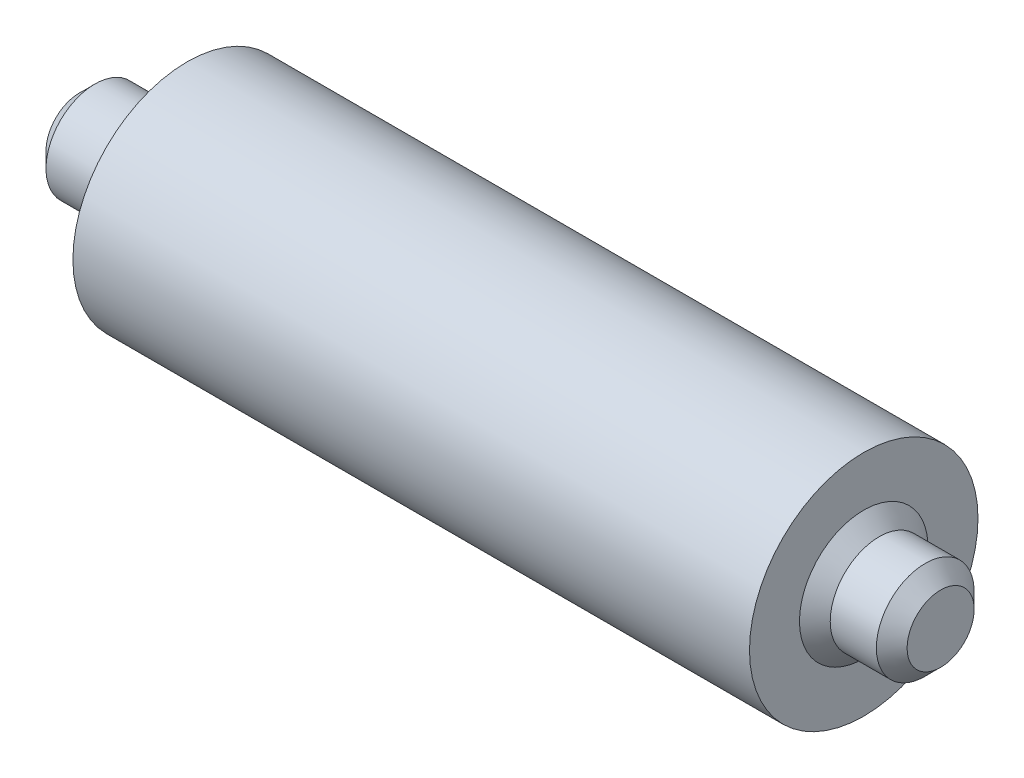
ISO-10303-21;
HEADER;
FILE_DESCRIPTION(('STEP AP214'),'2;1');
FILE_NAME('part.step','',(''),(''),'','','');
FILE_SCHEMA(('AUTOMOTIVE_DESIGN { 1 0 10303 214 1 1 1 1 }'));
ENDSEC;
DATA;
#1=APPLICATION_CONTEXT('core data for automotive mechanical design processes');
#2=APPLICATION_PROTOCOL_DEFINITION('international standard','automotive_design',2000,#1);
#3=PRODUCT_CONTEXT('',#1,'mechanical');
#4=PRODUCT('Part','Part','',(#3));
#5=PRODUCT_RELATED_PRODUCT_CATEGORY('part','',(#4));
#6=PRODUCT_DEFINITION_FORMATION('','',#4);
#7=PRODUCT_DEFINITION_CONTEXT('part definition',#1,'design');
#8=PRODUCT_DEFINITION('design','',#6,#7);
#9=PRODUCT_DEFINITION_SHAPE('','',#8);
#10=(LENGTH_UNIT() NAMED_UNIT(*) SI_UNIT(.MILLI.,.METRE.));
#11=(NAMED_UNIT(*) PLANE_ANGLE_UNIT() SI_UNIT($,.RADIAN.));
#12=(NAMED_UNIT(*) SI_UNIT($,.STERADIAN.) SOLID_ANGLE_UNIT());
#13=UNCERTAINTY_MEASURE_WITH_UNIT(LENGTH_MEASURE(1.E-05),#10,'distance_accuracy_value','');
#14=(GEOMETRIC_REPRESENTATION_CONTEXT(3) GLOBAL_UNCERTAINTY_ASSIGNED_CONTEXT((#13)) GLOBAL_UNIT_ASSIGNED_CONTEXT((#10,
#11,#12)) REPRESENTATION_CONTEXT('',''));
#15=CARTESIAN_POINT('',(0.,0.,0.));
#16=DIRECTION('',(0.,0.,1.));
#17=DIRECTION('',(1.,0.,0.));
#18=AXIS2_PLACEMENT_3D('',#15,#16,#17);
#19=CARTESIAN_POINT('',(-28.1428571428571,0.,0.));
#20=DIRECTION('',(1.,0.,0.));
#21=DIRECTION('',(0.,0.,-1.));
#22=AXIS2_PLACEMENT_3D('',#19,#20,#21);
#23=PLANE('',#22);
#24=CARTESIAN_POINT('',(-28.1428571428571,0.,0.));
#25=DIRECTION('',(1.,0.,0.));
#26=DIRECTION('',(0.,0.,-1.));
#27=AXIS2_PLACEMENT_3D('',#24,#25,#26);
#28=CIRCLE('',#27,2.18);
#29=CARTESIAN_POINT('',(-28.1428571428571,0.,-2.18));
#30=VERTEX_POINT('',#29);
#31=EDGE_CURVE('E75',#30,#30,#28,.F.);
#32=ORIENTED_EDGE('',*,*,#31,.T.);
#33=EDGE_LOOP('',(#32));
#34=FACE_BOUND('',#33,.T.);
#35=ADVANCED_FACE('F38',(#34),#23,.F.);
#36=CARTESIAN_POINT('',(-28.1428571428571,0.,0.));
#37=DIRECTION('',(-1.,0.,0.));
#38=DIRECTION('',(0.,0.,1.));
#39=AXIS2_PLACEMENT_3D('',#36,#37,#38);
#40=CYLINDRICAL_SURFACE('',#39,3.18);
#41=CARTESIAN_POINT('',(-22.1428571428571,0.,0.));
#42=DIRECTION('',(1.,0.,0.));
#43=DIRECTION('',(0.,0.,-1.));
#44=AXIS2_PLACEMENT_3D('',#41,#42,#43);
#45=CIRCLE('',#44,3.18);
#46=CARTESIAN_POINT('',(-22.1428571428571,0.,-3.18));
#47=VERTEX_POINT('',#46);
#48=EDGE_CURVE('E57',#47,#47,#45,.F.);
#49=ORIENTED_EDGE('',*,*,#48,.T.);
#50=EDGE_LOOP('',(#49));
#51=FACE_BOUND('',#50,.T.);
#52=CARTESIAN_POINT('',(-27.1428571428571,0.,0.));
#53=DIRECTION('',(1.,0.,0.));
#54=DIRECTION('',(0.,0.,-1.));
#55=AXIS2_PLACEMENT_3D('',#52,#53,#54);
#56=CIRCLE('',#55,3.18);
#57=CARTESIAN_POINT('',(-27.1428571428571,0.,-3.18));
#58=VERTEX_POINT('',#57);
#59=EDGE_CURVE('E71',#58,#58,#56,.T.);
#60=ORIENTED_EDGE('',*,*,#59,.T.);
#61=EDGE_LOOP('',(#60));
#62=FACE_BOUND('',#61,.T.);
#63=ADVANCED_FACE('F105',(#51,#62),#40,.T.);
#64=CARTESIAN_POINT('',(-21.1428571428571,3.18,0.));
#65=DIRECTION('',(1.,0.,0.));
#66=DIRECTION('',(0.,0.,-1.));
#67=AXIS2_PLACEMENT_3D('',#64,#65,#66);
#68=PLANE('',#67);
#69=CARTESIAN_POINT('',(-21.1428571428571,0.,0.));
#70=DIRECTION('',(1.,0.,0.));
#71=DIRECTION('',(0.,0.,-1.));
#72=AXIS2_PLACEMENT_3D('',#69,#70,#71);
#73=CIRCLE('',#72,4.17999999999999);
#74=CARTESIAN_POINT('',(-21.1428571428571,0.,-4.17999999999999));
#75=VERTEX_POINT('',#74);
#76=EDGE_CURVE('E52',#75,#75,#73,.T.);
#77=ORIENTED_EDGE('',*,*,#76,.T.);
#78=EDGE_LOOP('',(#77));
#79=FACE_BOUND('',#78,.T.);
#80=CARTESIAN_POINT('',(-21.1428571428571,0.,0.));
#81=DIRECTION('',(-1.,0.,0.));
#82=DIRECTION('',(0.,0.,1.));
#83=AXIS2_PLACEMENT_3D('',#80,#81,#82);
#84=CIRCLE('',#83,7.43);
#85=CARTESIAN_POINT('',(-21.1428571428571,0.,7.43));
#86=VERTEX_POINT('',#85);
#87=EDGE_CURVE('E79',#86,#86,#84,.T.);
#88=ORIENTED_EDGE('',*,*,#87,.T.);
#89=EDGE_LOOP('',(#88));
#90=FACE_BOUND('',#89,.T.);
#91=ADVANCED_FACE('F101',(#79,#90),#68,.F.);
#92=CARTESIAN_POINT('',(-28.1428571428571,0.,0.));
#93=DIRECTION('',(-1.,0.,0.));
#94=DIRECTION('',(0.,0.,1.));
#95=AXIS2_PLACEMENT_3D('',#92,#93,#94);
#96=CYLINDRICAL_SURFACE('',#95,7.43);
#97=ORIENTED_EDGE('',*,*,#87,.F.);
#98=EDGE_LOOP('',(#97));
#99=FACE_BOUND('',#98,.T.);
#100=CARTESIAN_POINT('',(22.8571428571429,0.,0.));
#101=DIRECTION('',(-1.,0.,0.));
#102=DIRECTION('',(0.,0.,1.));
#103=AXIS2_PLACEMENT_3D('',#100,#101,#102);
#104=CIRCLE('',#103,7.43);
#105=CARTESIAN_POINT('',(22.8571428571429,0.,7.43));
#106=VERTEX_POINT('',#105);
#107=EDGE_CURVE('E83',#106,#106,#104,.T.);
#108=ORIENTED_EDGE('',*,*,#107,.T.);
#109=EDGE_LOOP('',(#108));
#110=FACE_BOUND('',#109,.T.);
#111=ADVANCED_FACE('F88',(#99,#110),#96,.T.);
#112=CARTESIAN_POINT('',(22.8571428571429,7.43,0.));
#113=DIRECTION('',(-1.,0.,0.));
#114=DIRECTION('',(0.,0.,1.));
#115=AXIS2_PLACEMENT_3D('',#112,#113,#114);
#116=PLANE('',#115);
#117=CARTESIAN_POINT('',(22.8571428571429,0.,0.));
#118=DIRECTION('',(-1.,0.,0.));
#119=DIRECTION('',(0.,0.,1.));
#120=AXIS2_PLACEMENT_3D('',#117,#118,#119);
#121=CIRCLE('',#120,4.18000000000001);
#122=CARTESIAN_POINT('',(22.8571428571429,0.,4.18000000000001));
#123=VERTEX_POINT('',#122);
#124=EDGE_CURVE('E47',#123,#123,#121,.T.);
#125=ORIENTED_EDGE('',*,*,#124,.T.);
#126=EDGE_LOOP('',(#125));
#127=FACE_BOUND('',#126,.T.);
#128=ORIENTED_EDGE('',*,*,#107,.F.);
#129=EDGE_LOOP('',(#128));
#130=FACE_BOUND('',#129,.T.);
#131=ADVANCED_FACE('F90',(#127,#130),#116,.F.);
#132=CARTESIAN_POINT('',(-28.1428571428571,0.,0.));
#133=DIRECTION('',(-1.,0.,0.));
#134=DIRECTION('',(0.,0.,1.));
#135=AXIS2_PLACEMENT_3D('',#132,#133,#134);
#136=CYLINDRICAL_SURFACE('',#135,3.18);
#137=CARTESIAN_POINT('',(23.8571428571429,0.,0.));
#138=DIRECTION('',(-1.,0.,0.));
#139=DIRECTION('',(0.,0.,1.));
#140=AXIS2_PLACEMENT_3D('',#137,#138,#139);
#141=CIRCLE('',#140,3.18);
#142=CARTESIAN_POINT('',(23.8571428571429,0.,3.18));
#143=VERTEX_POINT('',#142);
#144=EDGE_CURVE('E10',#143,#143,#141,.F.);
#145=ORIENTED_EDGE('',*,*,#144,.T.);
#146=EDGE_LOOP('',(#145));
#147=FACE_BOUND('',#146,.T.);
#148=CARTESIAN_POINT('',(26.8571428571429,0.,0.));
#149=DIRECTION('',(-1.,0.,0.));
#150=DIRECTION('',(0.,0.,1.));
#151=AXIS2_PLACEMENT_3D('',#148,#149,#150);
#152=CIRCLE('',#151,3.18);
#153=CARTESIAN_POINT('',(26.8571428571429,0.,3.18));
#154=VERTEX_POINT('',#153);
#155=EDGE_CURVE('E67',#154,#154,#152,.T.);
#156=ORIENTED_EDGE('',*,*,#155,.T.);
#157=EDGE_LOOP('',(#156));
#158=FACE_BOUND('',#157,.T.);
#159=ADVANCED_FACE('F92',(#147,#158),#136,.T.);
#160=CARTESIAN_POINT('',(27.8571428571429,3.18,0.));
#161=DIRECTION('',(-1.,0.,0.));
#162=DIRECTION('',(0.,0.,1.));
#163=AXIS2_PLACEMENT_3D('',#160,#161,#162);
#164=PLANE('',#163);
#165=CARTESIAN_POINT('',(27.8571428571429,0.,0.));
#166=DIRECTION('',(-1.,0.,0.));
#167=DIRECTION('',(0.,0.,1.));
#168=AXIS2_PLACEMENT_3D('',#165,#166,#167);
#169=CIRCLE('',#168,2.18000000000002);
#170=CARTESIAN_POINT('',(27.8571428571429,0.,2.18000000000002));
#171=VERTEX_POINT('',#170);
#172=EDGE_CURVE('E63',#171,#171,#169,.F.);
#173=ORIENTED_EDGE('',*,*,#172,.T.);
#174=EDGE_LOOP('',(#173));
#175=FACE_BOUND('',#174,.T.);
#176=ADVANCED_FACE('F98',(#175),#164,.F.);
#177=CARTESIAN_POINT('',(-28.1428571428571,0.,0.));
#178=DIRECTION('',(1.,0.,0.));
#179=DIRECTION('',(0.,0.,-1.));
#180=AXIS2_PLACEMENT_3D('',#177,#178,#179);
#181=CONICAL_SURFACE('',#180,2.18,0.785398163397446);
#182=ORIENTED_EDGE('',*,*,#59,.F.);
#183=EDGE_LOOP('',(#182));
#184=FACE_BOUND('',#183,.T.);
#185=ORIENTED_EDGE('',*,*,#31,.F.);
#186=EDGE_LOOP('',(#185));
#187=FACE_BOUND('',#186,.T.);
#188=ADVANCED_FACE('F118',(#184,#187),#181,.T.);
#189=CARTESIAN_POINT('',(26.8571428571429,0.,0.));
#190=DIRECTION('',(-1.,0.,0.));
#191=DIRECTION('',(0.,0.,1.));
#192=AXIS2_PLACEMENT_3D('',#189,#190,#191);
#193=CONICAL_SURFACE('',#192,3.18,0.785398163397451);
#194=ORIENTED_EDGE('',*,*,#172,.F.);
#195=EDGE_LOOP('',(#194));
#196=FACE_BOUND('',#195,.T.);
#197=ORIENTED_EDGE('',*,*,#155,.F.);
#198=EDGE_LOOP('',(#197));
#199=FACE_BOUND('',#198,.T.);
#200=ADVANCED_FACE('F124',(#196,#199),#193,.T.);
#201=CARTESIAN_POINT('',(-22.1428571428571,0.,0.));
#202=DIRECTION('',(1.,0.,0.));
#203=DIRECTION('',(0.,0.,-1.));
#204=AXIS2_PLACEMENT_3D('',#201,#202,#203);
#205=CONICAL_SURFACE('',#204,3.18,0.785398163397441);
#206=ORIENTED_EDGE('',*,*,#76,.F.);
#207=EDGE_LOOP('',(#206));
#208=FACE_BOUND('',#207,.T.);
#209=ORIENTED_EDGE('',*,*,#48,.F.);
#210=EDGE_LOOP('',(#209));
#211=FACE_BOUND('',#210,.T.);
#212=ADVANCED_FACE('F130',(#208,#211),#205,.T.);
#213=CARTESIAN_POINT('',(22.8571428571429,0.,0.));
#214=DIRECTION('',(-1.,0.,0.));
#215=DIRECTION('',(0.,0.,1.));
#216=AXIS2_PLACEMENT_3D('',#213,#214,#215);
#217=CONICAL_SURFACE('',#216,4.18000000000001,0.785398163397453);
#218=ORIENTED_EDGE('',*,*,#144,.F.);
#219=EDGE_LOOP('',(#218));
#220=FACE_BOUND('',#219,.T.);
#221=ORIENTED_EDGE('',*,*,#124,.F.);
#222=EDGE_LOOP('',(#221));
#223=FACE_BOUND('',#222,.T.);
#224=ADVANCED_FACE('F41',(#220,#223),#217,.T.);
#225=CLOSED_SHELL('',(#35,#63,#91,#111,#131,#159,#176,#188,#200,#212,#224));
#226=MANIFOLD_SOLID_BREP('B2',#225);
#227=ADVANCED_BREP_SHAPE_REPRESENTATION('',(#18,#226),#14);
#228=SHAPE_DEFINITION_REPRESENTATION(#9,#227);
ENDSEC;
END-ISO-10303-21;
